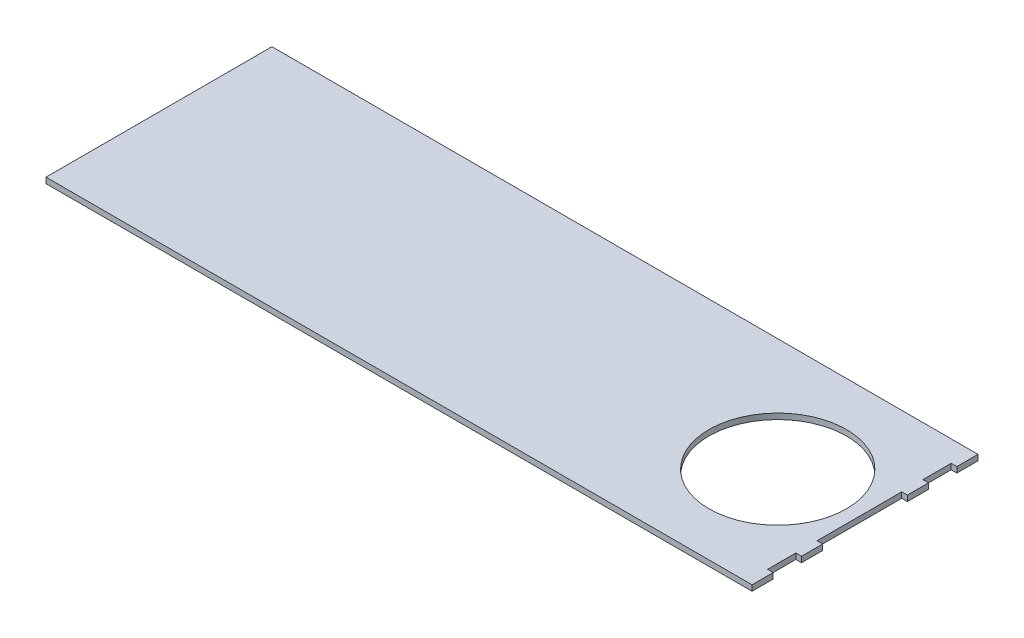
ISO-10303-21;
HEADER;
FILE_DESCRIPTION(('STEP AP214'),'2;1');
FILE_NAME('part.step','',(''),(''),'','','');
FILE_SCHEMA(('AUTOMOTIVE_DESIGN { 1 0 10303 214 1 1 1 1 }'));
ENDSEC;
DATA;
#1=APPLICATION_CONTEXT('core data for automotive mechanical design processes');
#2=APPLICATION_PROTOCOL_DEFINITION('international standard','automotive_design',2000,#1);
#3=PRODUCT_CONTEXT('',#1,'mechanical');
#4=PRODUCT('Part','Part','',(#3));
#5=PRODUCT_RELATED_PRODUCT_CATEGORY('part','',(#4));
#6=PRODUCT_DEFINITION_FORMATION('','',#4);
#7=PRODUCT_DEFINITION_CONTEXT('part definition',#1,'design');
#8=PRODUCT_DEFINITION('design','',#6,#7);
#9=PRODUCT_DEFINITION_SHAPE('','',#8);
#10=(LENGTH_UNIT() NAMED_UNIT(*) SI_UNIT(.MILLI.,.METRE.));
#11=(NAMED_UNIT(*) PLANE_ANGLE_UNIT() SI_UNIT($,.RADIAN.));
#12=(NAMED_UNIT(*) SI_UNIT($,.STERADIAN.) SOLID_ANGLE_UNIT());
#13=UNCERTAINTY_MEASURE_WITH_UNIT(LENGTH_MEASURE(1.E-05),#10,'distance_accuracy_value','');
#14=(GEOMETRIC_REPRESENTATION_CONTEXT(3) GLOBAL_UNCERTAINTY_ASSIGNED_CONTEXT((#13)) GLOBAL_UNIT_ASSIGNED_CONTEXT((#10,
#11,#12)) REPRESENTATION_CONTEXT('',''));
#15=CARTESIAN_POINT('',(0.,0.,0.));
#16=DIRECTION('',(0.,0.,1.));
#17=DIRECTION('',(1.,0.,0.));
#18=AXIS2_PLACEMENT_3D('',#15,#16,#17);
#19=CARTESIAN_POINT('',(317.5,5.08,101.6));
#20=DIRECTION('',(-1.,0.,0.));
#21=DIRECTION('',(0.,0.,1.));
#22=AXIS2_PLACEMENT_3D('',#19,#20,#21);
#23=PLANE('',#22);
#24=DIRECTION('',(0.,0.,-1.));
#25=VECTOR('',#24,1.);
#26=CARTESIAN_POINT('',(317.5,0.,101.6));
#27=LINE('',#26,#25);
#28=CARTESIAN_POINT('',(317.5,0.,57.15));
#29=VERTEX_POINT('',#28);
#30=CARTESIAN_POINT('',(317.5,0.,38.0999999999999));
#31=VERTEX_POINT('',#30);
#32=EDGE_CURVE('E201',#29,#31,#27,.T.);
#33=ORIENTED_EDGE('',*,*,#32,.T.);
#34=DIRECTION('',(0.,1.,0.));
#35=VECTOR('',#34,1.);
#36=CARTESIAN_POINT('',(317.5,-76.3691456021344,38.0999999999999));
#37=LINE('',#36,#35);
#38=CARTESIAN_POINT('',(317.5,5.08,38.0999999999999));
#39=VERTEX_POINT('',#38);
#40=EDGE_CURVE('E285',#31,#39,#37,.T.);
#41=ORIENTED_EDGE('',*,*,#40,.T.);
#42=DIRECTION('',(0.,0.,-1.));
#43=VECTOR('',#42,1.);
#44=CARTESIAN_POINT('',(317.5,5.08,101.6));
#45=LINE('',#44,#43);
#46=CARTESIAN_POINT('',(317.5,5.08,57.15));
#47=VERTEX_POINT('',#46);
#48=EDGE_CURVE('E170',#47,#39,#45,.T.);
#49=ORIENTED_EDGE('',*,*,#48,.F.);
#50=DIRECTION('',(0.,1.,0.));
#51=VECTOR('',#50,1.);
#52=CARTESIAN_POINT('',(317.5,-76.3691456021344,57.15));
#53=LINE('',#52,#51);
#54=EDGE_CURVE('E239',#29,#47,#53,.T.);
#55=ORIENTED_EDGE('',*,*,#54,.F.);
#56=EDGE_LOOP('',(#33,#41,#49,#55));
#57=FACE_BOUND('',#56,.T.);
#58=ADVANCED_FACE('F33',(#57),#23,.F.);
#59=CARTESIAN_POINT('',(317.5,0.,101.6));
#60=VERTEX_POINT('',#59);
#61=CARTESIAN_POINT('',(317.5,0.,82.55));
#62=VERTEX_POINT('',#61);
#63=EDGE_CURVE('E197',#60,#62,#27,.T.);
#64=ORIENTED_EDGE('',*,*,#63,.T.);
#65=DIRECTION('',(0.,1.,0.));
#66=VECTOR('',#65,1.);
#67=CARTESIAN_POINT('',(317.5,-76.3691456021344,82.55));
#68=LINE('',#67,#66);
#69=CARTESIAN_POINT('',(317.5,5.08,82.55));
#70=VERTEX_POINT('',#69);
#71=EDGE_CURVE('E228',#62,#70,#68,.T.);
#72=ORIENTED_EDGE('',*,*,#71,.T.);
#73=CARTESIAN_POINT('',(317.5,5.08,101.6));
#74=VERTEX_POINT('',#73);
#75=EDGE_CURVE('E173',#74,#70,#45,.T.);
#76=ORIENTED_EDGE('',*,*,#75,.F.);
#77=DIRECTION('',(0.,-1.,0.));
#78=VECTOR('',#77,1.);
#79=CARTESIAN_POINT('',(317.5,5.08,101.6));
#80=LINE('',#79,#78);
#81=EDGE_CURVE('E41',#74,#60,#80,.T.);
#82=ORIENTED_EDGE('',*,*,#81,.T.);
#83=EDGE_LOOP('',(#64,#72,#76,#82));
#84=FACE_BOUND('',#83,.T.);
#85=ADVANCED_FACE('F210',(#84),#23,.F.);
#86=CARTESIAN_POINT('',(317.5,5.08,-38.1000000000001));
#87=VERTEX_POINT('',#86);
#88=CARTESIAN_POINT('',(317.5,5.08,-57.1500000000001));
#89=VERTEX_POINT('',#88);
#90=EDGE_CURVE('E160',#87,#89,#45,.T.);
#91=ORIENTED_EDGE('',*,*,#90,.F.);
#92=DIRECTION('',(0.,1.,0.));
#93=VECTOR('',#92,1.);
#94=CARTESIAN_POINT('',(317.5,-76.3691456021344,-38.1000000000001));
#95=LINE('',#94,#93);
#96=CARTESIAN_POINT('',(317.5,0.,-38.1000000000001));
#97=VERTEX_POINT('',#96);
#98=EDGE_CURVE('E144',#97,#87,#95,.T.);
#99=ORIENTED_EDGE('',*,*,#98,.F.);
#100=CARTESIAN_POINT('',(317.5,0.,-57.1500000000001));
#101=VERTEX_POINT('',#100);
#102=EDGE_CURVE('E202',#97,#101,#27,.T.);
#103=ORIENTED_EDGE('',*,*,#102,.T.);
#104=DIRECTION('',(0.,1.,0.));
#105=VECTOR('',#104,1.);
#106=CARTESIAN_POINT('',(317.5,-76.3691456021344,-57.1500000000001));
#107=LINE('',#106,#105);
#108=EDGE_CURVE('E169',#101,#89,#107,.T.);
#109=ORIENTED_EDGE('',*,*,#108,.T.);
#110=EDGE_LOOP('',(#91,#99,#103,#109));
#111=FACE_BOUND('',#110,.T.);
#112=ADVANCED_FACE('F167',(#111),#23,.F.);
#113=CARTESIAN_POINT('',(-317.5,5.08,101.6));
#114=DIRECTION('',(1.,0.,0.));
#115=DIRECTION('',(0.,0.,-1.));
#116=AXIS2_PLACEMENT_3D('',#113,#114,#115);
#117=PLANE('',#116);
#118=DIRECTION('',(0.,0.,1.));
#119=VECTOR('',#118,1.);
#120=CARTESIAN_POINT('',(-317.5,0.,101.6));
#121=LINE('',#120,#119);
#122=CARTESIAN_POINT('',(-317.5,0.,-101.6));
#123=VERTEX_POINT('',#122);
#124=CARTESIAN_POINT('',(-317.5,0.,101.6));
#125=VERTEX_POINT('',#124);
#126=EDGE_CURVE('E190',#123,#125,#121,.T.);
#127=ORIENTED_EDGE('',*,*,#126,.T.);
#128=DIRECTION('',(0.,-1.,0.));
#129=VECTOR('',#128,1.);
#130=CARTESIAN_POINT('',(-317.5,5.08,101.6));
#131=LINE('',#130,#129);
#132=CARTESIAN_POINT('',(-317.5,5.08,101.6));
#133=VERTEX_POINT('',#132);
#134=EDGE_CURVE('E11',#133,#125,#131,.T.);
#135=ORIENTED_EDGE('',*,*,#134,.F.);
#136=DIRECTION('',(0.,0.,1.));
#137=VECTOR('',#136,1.);
#138=CARTESIAN_POINT('',(-317.5,5.08,101.6));
#139=LINE('',#138,#137);
#140=CARTESIAN_POINT('',(-317.5,5.08,-101.6));
#141=VERTEX_POINT('',#140);
#142=EDGE_CURVE('E203',#141,#133,#139,.T.);
#143=ORIENTED_EDGE('',*,*,#142,.F.);
#144=DIRECTION('',(0.,-1.,0.));
#145=VECTOR('',#144,1.);
#146=CARTESIAN_POINT('',(-317.5,5.08,-101.6));
#147=LINE('',#146,#145);
#148=EDGE_CURVE('E182',#141,#123,#147,.T.);
#149=ORIENTED_EDGE('',*,*,#148,.T.);
#150=EDGE_LOOP('',(#127,#135,#143,#149));
#151=FACE_BOUND('',#150,.T.);
#152=ADVANCED_FACE('F35',(#151),#117,.F.);
#153=CARTESIAN_POINT('',(317.5,5.08,101.6));
#154=DIRECTION('',(0.,0.,-1.));
#155=DIRECTION('',(-1.,0.,0.));
#156=AXIS2_PLACEMENT_3D('',#153,#154,#155);
#157=PLANE('',#156);
#158=DIRECTION('',(1.,0.,0.));
#159=VECTOR('',#158,1.);
#160=CARTESIAN_POINT('',(317.5,0.,101.6));
#161=LINE('',#160,#159);
#162=EDGE_CURVE('E193',#125,#60,#161,.T.);
#163=ORIENTED_EDGE('',*,*,#162,.T.);
#164=ORIENTED_EDGE('',*,*,#81,.F.);
#165=DIRECTION('',(1.,0.,0.));
#166=VECTOR('',#165,1.);
#167=CARTESIAN_POINT('',(317.5,5.08,101.6));
#168=LINE('',#167,#166);
#169=EDGE_CURVE('E175',#133,#74,#168,.T.);
#170=ORIENTED_EDGE('',*,*,#169,.F.);
#171=ORIENTED_EDGE('',*,*,#134,.T.);
#172=EDGE_LOOP('',(#163,#164,#170,#171));
#173=FACE_BOUND('',#172,.T.);
#174=ADVANCED_FACE('F267',(#173),#157,.F.);
#175=CARTESIAN_POINT('',(317.5,5.08,-82.5500000000001));
#176=VERTEX_POINT('',#175);
#177=CARTESIAN_POINT('',(317.5,5.08,-101.6));
#178=VERTEX_POINT('',#177);
#179=EDGE_CURVE('E171',#176,#178,#45,.T.);
#180=ORIENTED_EDGE('',*,*,#179,.F.);
#181=DIRECTION('',(0.,1.,0.));
#182=VECTOR('',#181,1.);
#183=CARTESIAN_POINT('',(317.5,-76.3691456021344,-82.5500000000001));
#184=LINE('',#183,#182);
#185=CARTESIAN_POINT('',(317.5,0.,-82.5500000000001));
#186=VERTEX_POINT('',#185);
#187=EDGE_CURVE('E257',#186,#176,#184,.T.);
#188=ORIENTED_EDGE('',*,*,#187,.F.);
#189=CARTESIAN_POINT('',(317.5,0.,-101.6));
#190=VERTEX_POINT('',#189);
#191=EDGE_CURVE('E196',#186,#190,#27,.T.);
#192=ORIENTED_EDGE('',*,*,#191,.T.);
#193=DIRECTION('',(0.,-1.,0.));
#194=VECTOR('',#193,1.);
#195=CARTESIAN_POINT('',(317.5,5.08,-101.6));
#196=LINE('',#195,#194);
#197=EDGE_CURVE('E187',#178,#190,#196,.T.);
#198=ORIENTED_EDGE('',*,*,#197,.F.);
#199=EDGE_LOOP('',(#180,#188,#192,#198));
#200=FACE_BOUND('',#199,.T.);
#201=ADVANCED_FACE('F277',(#200),#23,.F.);
#202=CARTESIAN_POINT('',(317.5,5.08,-101.6));
#203=DIRECTION('',(0.,0.,1.));
#204=DIRECTION('',(1.,0.,0.));
#205=AXIS2_PLACEMENT_3D('',#202,#203,#204);
#206=PLANE('',#205);
#207=DIRECTION('',(-1.,0.,0.));
#208=VECTOR('',#207,1.);
#209=CARTESIAN_POINT('',(317.5,0.,-101.6));
#210=LINE('',#209,#208);
#211=EDGE_CURVE('E200',#190,#123,#210,.T.);
#212=ORIENTED_EDGE('',*,*,#211,.T.);
#213=ORIENTED_EDGE('',*,*,#148,.F.);
#214=DIRECTION('',(-1.,0.,0.));
#215=VECTOR('',#214,1.);
#216=CARTESIAN_POINT('',(317.5,5.08,-101.6));
#217=LINE('',#216,#215);
#218=EDGE_CURVE('E179',#178,#141,#217,.T.);
#219=ORIENTED_EDGE('',*,*,#218,.F.);
#220=ORIENTED_EDGE('',*,*,#197,.T.);
#221=EDGE_LOOP('',(#212,#213,#219,#220));
#222=FACE_BOUND('',#221,.T.);
#223=ADVANCED_FACE('F273',(#222),#206,.F.);
#224=CARTESIAN_POINT('',(0.,5.08,0.));
#225=DIRECTION('',(0.,1.,0.));
#226=DIRECTION('',(0.,0.,1.));
#227=AXIS2_PLACEMENT_3D('',#224,#225,#226);
#228=PLANE('',#227);
#229=CARTESIAN_POINT('',(238.966470335924,5.08,0.));
#230=DIRECTION('',(0.,1.,0.));
#231=DIRECTION('',(0.,0.,1.));
#232=AXIS2_PLACEMENT_3D('',#229,#230,#231);
#233=CIRCLE('',#232,61.8098417908649);
#234=CARTESIAN_POINT('',(238.966470335924,5.08,61.8098417908648));
#235=VERTEX_POINT('',#234);
#236=EDGE_CURVE('E466',#235,#235,#233,.T.);
#237=ORIENTED_EDGE('',*,*,#236,.F.);
#238=EDGE_LOOP('',(#237));
#239=FACE_BOUND('',#238,.T.);
#240=DIRECTION('',(1.,0.,0.));
#241=VECTOR('',#240,1.);
#242=CARTESIAN_POINT('',(317.5,5.08,38.0999999999999));
#243=LINE('',#242,#241);
#244=CARTESIAN_POINT('',(312.42,5.08,38.0999999999999));
#245=VERTEX_POINT('',#244);
#246=EDGE_CURVE('E154',#245,#39,#243,.T.);
#247=ORIENTED_EDGE('',*,*,#246,.F.);
#248=DIRECTION('',(0.,0.,1.));
#249=VECTOR('',#248,1.);
#250=CARTESIAN_POINT('',(312.42,5.08,-38.1000000000001));
#251=LINE('',#250,#249);
#252=CARTESIAN_POINT('',(312.42,5.08,-38.1000000000001));
#253=VERTEX_POINT('',#252);
#254=EDGE_CURVE('E163',#253,#245,#251,.T.);
#255=ORIENTED_EDGE('',*,*,#254,.F.);
#256=DIRECTION('',(-1.,0.,0.));
#257=VECTOR('',#256,1.);
#258=CARTESIAN_POINT('',(317.5,5.08,-38.1000000000001));
#259=LINE('',#258,#257);
#260=EDGE_CURVE('E147',#87,#253,#259,.T.);
#261=ORIENTED_EDGE('',*,*,#260,.F.);
#262=ORIENTED_EDGE('',*,*,#90,.T.);
#263=DIRECTION('',(1.,0.,0.));
#264=VECTOR('',#263,1.);
#265=CARTESIAN_POINT('',(317.5,5.08,-57.1500000000001));
#266=LINE('',#265,#264);
#267=CARTESIAN_POINT('',(312.42,5.08,-57.1500000000001));
#268=VERTEX_POINT('',#267);
#269=EDGE_CURVE('E255',#268,#89,#266,.T.);
#270=ORIENTED_EDGE('',*,*,#269,.F.);
#271=DIRECTION('',(0.,0.,1.));
#272=VECTOR('',#271,1.);
#273=CARTESIAN_POINT('',(312.42,5.08,-82.5500000000001));
#274=LINE('',#273,#272);
#275=CARTESIAN_POINT('',(312.42,5.08,-82.5500000000001));
#276=VERTEX_POINT('',#275);
#277=EDGE_CURVE('E252',#276,#268,#274,.T.);
#278=ORIENTED_EDGE('',*,*,#277,.F.);
#279=DIRECTION('',(-1.,0.,0.));
#280=VECTOR('',#279,1.);
#281=CARTESIAN_POINT('',(317.5,5.08,-82.5500000000001));
#282=LINE('',#281,#280);
#283=EDGE_CURVE('E226',#176,#276,#282,.T.);
#284=ORIENTED_EDGE('',*,*,#283,.F.);
#285=ORIENTED_EDGE('',*,*,#179,.T.);
#286=ORIENTED_EDGE('',*,*,#218,.T.);
#287=ORIENTED_EDGE('',*,*,#142,.T.);
#288=ORIENTED_EDGE('',*,*,#169,.T.);
#289=ORIENTED_EDGE('',*,*,#75,.T.);
#290=DIRECTION('',(1.,0.,0.));
#291=VECTOR('',#290,1.);
#292=CARTESIAN_POINT('',(317.5,5.08,82.55));
#293=LINE('',#292,#291);
#294=CARTESIAN_POINT('',(312.42,5.08,82.55));
#295=VERTEX_POINT('',#294);
#296=EDGE_CURVE('E237',#295,#70,#293,.T.);
#297=ORIENTED_EDGE('',*,*,#296,.F.);
#298=DIRECTION('',(0.,0.,1.));
#299=VECTOR('',#298,1.);
#300=CARTESIAN_POINT('',(312.42,5.08,57.15));
#301=LINE('',#300,#299);
#302=CARTESIAN_POINT('',(312.42,5.08,57.15));
#303=VERTEX_POINT('',#302);
#304=EDGE_CURVE('E234',#303,#295,#301,.T.);
#305=ORIENTED_EDGE('',*,*,#304,.F.);
#306=DIRECTION('',(-1.,0.,0.));
#307=VECTOR('',#306,1.);
#308=CARTESIAN_POINT('',(317.5,5.08,57.15));
#309=LINE('',#308,#307);
#310=EDGE_CURVE('E232',#47,#303,#309,.T.);
#311=ORIENTED_EDGE('',*,*,#310,.F.);
#312=ORIENTED_EDGE('',*,*,#48,.T.);
#313=EDGE_LOOP('',(#247,#255,#261,#262,#270,#278,#284,#285,#286,#287,#288,#289,#297,#305,#311,#312));
#314=FACE_BOUND('',#313,.T.);
#315=ADVANCED_FACE('F158',(#239,#314),#228,.T.);
#316=CARTESIAN_POINT('',(0.,0.,0.));
#317=DIRECTION('',(0.,1.,0.));
#318=DIRECTION('',(0.,0.,1.));
#319=AXIS2_PLACEMENT_3D('',#316,#317,#318);
#320=PLANE('',#319);
#321=CARTESIAN_POINT('',(238.966470335924,0.,0.));
#322=DIRECTION('',(0.,1.,0.));
#323=DIRECTION('',(0.,0.,1.));
#324=AXIS2_PLACEMENT_3D('',#321,#322,#323);
#325=CIRCLE('',#324,61.8098417908649);
#326=CARTESIAN_POINT('',(238.966470335924,0.,61.8098417908648));
#327=VERTEX_POINT('',#326);
#328=EDGE_CURVE('E164',#327,#327,#325,.F.);
#329=ORIENTED_EDGE('',*,*,#328,.F.);
#330=EDGE_LOOP('',(#329));
#331=FACE_BOUND('',#330,.T.);
#332=DIRECTION('',(0.,0.,-1.));
#333=VECTOR('',#332,1.);
#334=CARTESIAN_POINT('',(312.42,0.,-38.1000000000001));
#335=LINE('',#334,#333);
#336=CARTESIAN_POINT('',(312.42,0.,38.0999999999999));
#337=VERTEX_POINT('',#336);
#338=CARTESIAN_POINT('',(312.42,0.,-38.1000000000001));
#339=VERTEX_POINT('',#338);
#340=EDGE_CURVE('E288',#337,#339,#335,.T.);
#341=ORIENTED_EDGE('',*,*,#340,.F.);
#342=DIRECTION('',(-1.,0.,0.));
#343=VECTOR('',#342,1.);
#344=CARTESIAN_POINT('',(317.5,0.,38.0999999999999));
#345=LINE('',#344,#343);
#346=EDGE_CURVE('E287',#31,#337,#345,.T.);
#347=ORIENTED_EDGE('',*,*,#346,.F.);
#348=ORIENTED_EDGE('',*,*,#32,.F.);
#349=DIRECTION('',(1.,0.,0.));
#350=VECTOR('',#349,1.);
#351=CARTESIAN_POINT('',(317.5,0.,57.15));
#352=LINE('',#351,#350);
#353=CARTESIAN_POINT('',(312.42,0.,57.15));
#354=VERTEX_POINT('',#353);
#355=EDGE_CURVE('E224',#354,#29,#352,.T.);
#356=ORIENTED_EDGE('',*,*,#355,.F.);
#357=DIRECTION('',(0.,0.,-1.));
#358=VECTOR('',#357,1.);
#359=CARTESIAN_POINT('',(312.42,0.,57.15));
#360=LINE('',#359,#358);
#361=CARTESIAN_POINT('',(312.42,0.,82.55));
#362=VERTEX_POINT('',#361);
#363=EDGE_CURVE('E221',#362,#354,#360,.T.);
#364=ORIENTED_EDGE('',*,*,#363,.F.);
#365=DIRECTION('',(-1.,0.,0.));
#366=VECTOR('',#365,1.);
#367=CARTESIAN_POINT('',(317.5,0.,82.55));
#368=LINE('',#367,#366);
#369=EDGE_CURVE('E219',#62,#362,#368,.T.);
#370=ORIENTED_EDGE('',*,*,#369,.F.);
#371=ORIENTED_EDGE('',*,*,#63,.F.);
#372=ORIENTED_EDGE('',*,*,#162,.F.);
#373=ORIENTED_EDGE('',*,*,#126,.F.);
#374=ORIENTED_EDGE('',*,*,#211,.F.);
#375=ORIENTED_EDGE('',*,*,#191,.F.);
#376=DIRECTION('',(1.,0.,0.));
#377=VECTOR('',#376,1.);
#378=CARTESIAN_POINT('',(317.5,0.,-82.5500000000001));
#379=LINE('',#378,#377);
#380=CARTESIAN_POINT('',(312.42,0.,-82.5500000000001));
#381=VERTEX_POINT('',#380);
#382=EDGE_CURVE('E194',#381,#186,#379,.T.);
#383=ORIENTED_EDGE('',*,*,#382,.F.);
#384=DIRECTION('',(0.,0.,-1.));
#385=VECTOR('',#384,1.);
#386=CARTESIAN_POINT('',(312.42,0.,-82.5500000000001));
#387=LINE('',#386,#385);
#388=CARTESIAN_POINT('',(312.42,0.,-57.1500000000001));
#389=VERTEX_POINT('',#388);
#390=EDGE_CURVE('E245',#389,#381,#387,.T.);
#391=ORIENTED_EDGE('',*,*,#390,.F.);
#392=DIRECTION('',(-1.,0.,0.));
#393=VECTOR('',#392,1.);
#394=CARTESIAN_POINT('',(317.5,0.,-57.1500000000001));
#395=LINE('',#394,#393);
#396=EDGE_CURVE('E248',#101,#389,#395,.T.);
#397=ORIENTED_EDGE('',*,*,#396,.F.);
#398=ORIENTED_EDGE('',*,*,#102,.F.);
#399=DIRECTION('',(1.,0.,0.));
#400=VECTOR('',#399,1.);
#401=CARTESIAN_POINT('',(317.5,0.,-38.1000000000001));
#402=LINE('',#401,#400);
#403=EDGE_CURVE('E150',#339,#97,#402,.T.);
#404=ORIENTED_EDGE('',*,*,#403,.F.);
#405=EDGE_LOOP('',(#341,#347,#348,#356,#364,#370,#371,#372,#373,#374,#375,#383,#391,#397,#398,#404));
#406=FACE_BOUND('',#405,.T.);
#407=ADVANCED_FACE('F216',(#331,#406),#320,.F.);
#408=CARTESIAN_POINT('',(317.5,-76.3691456021344,-57.1500000000001));
#409=DIRECTION('',(0.,0.,1.));
#410=DIRECTION('',(1.,0.,0.));
#411=AXIS2_PLACEMENT_3D('',#408,#409,#410);
#412=PLANE('',#411);
#413=ORIENTED_EDGE('',*,*,#396,.T.);
#414=DIRECTION('',(0.,1.,0.));
#415=VECTOR('',#414,1.);
#416=CARTESIAN_POINT('',(312.42,-76.3691456021344,-57.1500000000001));
#417=LINE('',#416,#415);
#418=EDGE_CURVE('E259',#389,#268,#417,.T.);
#419=ORIENTED_EDGE('',*,*,#418,.T.);
#420=ORIENTED_EDGE('',*,*,#269,.T.);
#421=ORIENTED_EDGE('',*,*,#108,.F.);
#422=EDGE_LOOP('',(#413,#419,#420,#421));
#423=FACE_BOUND('',#422,.T.);
#424=ADVANCED_FACE('F305',(#423),#412,.F.);
#425=CARTESIAN_POINT('',(312.42,-76.3691456021344,-82.5500000000001));
#426=DIRECTION('',(-1.,0.,0.));
#427=DIRECTION('',(0.,0.,1.));
#428=AXIS2_PLACEMENT_3D('',#425,#426,#427);
#429=PLANE('',#428);
#430=ORIENTED_EDGE('',*,*,#390,.T.);
#431=DIRECTION('',(0.,1.,0.));
#432=VECTOR('',#431,1.);
#433=CARTESIAN_POINT('',(312.42,-76.3691456021344,-82.5500000000001));
#434=LINE('',#433,#432);
#435=EDGE_CURVE('E261',#381,#276,#434,.T.);
#436=ORIENTED_EDGE('',*,*,#435,.T.);
#437=ORIENTED_EDGE('',*,*,#277,.T.);
#438=ORIENTED_EDGE('',*,*,#418,.F.);
#439=EDGE_LOOP('',(#430,#436,#437,#438));
#440=FACE_BOUND('',#439,.T.);
#441=ADVANCED_FACE('F310',(#440),#429,.F.);
#442=CARTESIAN_POINT('',(317.5,-76.3691456021344,-82.5500000000001));
#443=DIRECTION('',(0.,0.,-1.));
#444=DIRECTION('',(-1.,0.,0.));
#445=AXIS2_PLACEMENT_3D('',#442,#443,#444);
#446=PLANE('',#445);
#447=ORIENTED_EDGE('',*,*,#382,.T.);
#448=ORIENTED_EDGE('',*,*,#187,.T.);
#449=ORIENTED_EDGE('',*,*,#283,.T.);
#450=ORIENTED_EDGE('',*,*,#435,.F.);
#451=EDGE_LOOP('',(#447,#448,#449,#450));
#452=FACE_BOUND('',#451,.T.);
#453=ADVANCED_FACE('F312',(#452),#446,.F.);
#454=CARTESIAN_POINT('',(317.5,-76.3691456021344,82.55));
#455=DIRECTION('',(0.,0.,1.));
#456=DIRECTION('',(1.,0.,0.));
#457=AXIS2_PLACEMENT_3D('',#454,#455,#456);
#458=PLANE('',#457);
#459=ORIENTED_EDGE('',*,*,#369,.T.);
#460=DIRECTION('',(0.,1.,0.));
#461=VECTOR('',#460,1.);
#462=CARTESIAN_POINT('',(312.42,-76.3691456021344,82.55));
#463=LINE('',#462,#461);
#464=EDGE_CURVE('E241',#362,#295,#463,.T.);
#465=ORIENTED_EDGE('',*,*,#464,.T.);
#466=ORIENTED_EDGE('',*,*,#296,.T.);
#467=ORIENTED_EDGE('',*,*,#71,.F.);
#468=EDGE_LOOP('',(#459,#465,#466,#467));
#469=FACE_BOUND('',#468,.T.);
#470=ADVANCED_FACE('F314',(#469),#458,.F.);
#471=CARTESIAN_POINT('',(312.42,-76.3691456021344,57.15));
#472=DIRECTION('',(-1.,0.,0.));
#473=DIRECTION('',(0.,0.,1.));
#474=AXIS2_PLACEMENT_3D('',#471,#472,#473);
#475=PLANE('',#474);
#476=ORIENTED_EDGE('',*,*,#363,.T.);
#477=DIRECTION('',(0.,1.,0.));
#478=VECTOR('',#477,1.);
#479=CARTESIAN_POINT('',(312.42,-76.3691456021344,57.15));
#480=LINE('',#479,#478);
#481=EDGE_CURVE('E56',#354,#303,#480,.T.);
#482=ORIENTED_EDGE('',*,*,#481,.T.);
#483=ORIENTED_EDGE('',*,*,#304,.T.);
#484=ORIENTED_EDGE('',*,*,#464,.F.);
#485=EDGE_LOOP('',(#476,#482,#483,#484));
#486=FACE_BOUND('',#485,.T.);
#487=ADVANCED_FACE('F320',(#486),#475,.F.);
#488=CARTESIAN_POINT('',(317.5,-76.3691456021344,57.15));
#489=DIRECTION('',(0.,0.,-1.));
#490=DIRECTION('',(-1.,0.,0.));
#491=AXIS2_PLACEMENT_3D('',#488,#489,#490);
#492=PLANE('',#491);
#493=ORIENTED_EDGE('',*,*,#355,.T.);
#494=ORIENTED_EDGE('',*,*,#54,.T.);
#495=ORIENTED_EDGE('',*,*,#310,.T.);
#496=ORIENTED_EDGE('',*,*,#481,.F.);
#497=EDGE_LOOP('',(#493,#494,#495,#496));
#498=FACE_BOUND('',#497,.T.);
#499=ADVANCED_FACE('F415',(#498),#492,.F.);
#500=CARTESIAN_POINT('',(317.5,-76.3691456021344,38.0999999999999));
#501=DIRECTION('',(0.,0.,1.));
#502=DIRECTION('',(1.,0.,0.));
#503=AXIS2_PLACEMENT_3D('',#500,#501,#502);
#504=PLANE('',#503);
#505=ORIENTED_EDGE('',*,*,#346,.T.);
#506=DIRECTION('',(0.,1.,0.));
#507=VECTOR('',#506,1.);
#508=CARTESIAN_POINT('',(312.42,-76.3691456021344,38.0999999999999));
#509=LINE('',#508,#507);
#510=EDGE_CURVE('E298',#337,#245,#509,.T.);
#511=ORIENTED_EDGE('',*,*,#510,.T.);
#512=ORIENTED_EDGE('',*,*,#246,.T.);
#513=ORIENTED_EDGE('',*,*,#40,.F.);
#514=EDGE_LOOP('',(#505,#511,#512,#513));
#515=FACE_BOUND('',#514,.T.);
#516=ADVANCED_FACE('F425',(#515),#504,.F.);
#517=CARTESIAN_POINT('',(312.42,-76.3691456021344,-38.1000000000001));
#518=DIRECTION('',(-1.,0.,0.));
#519=DIRECTION('',(0.,0.,1.));
#520=AXIS2_PLACEMENT_3D('',#517,#518,#519);
#521=PLANE('',#520);
#522=ORIENTED_EDGE('',*,*,#340,.T.);
#523=DIRECTION('',(0.,1.,0.));
#524=VECTOR('',#523,1.);
#525=CARTESIAN_POINT('',(312.42,-76.3691456021344,-38.1000000000001));
#526=LINE('',#525,#524);
#527=EDGE_CURVE('E48',#339,#253,#526,.T.);
#528=ORIENTED_EDGE('',*,*,#527,.T.);
#529=ORIENTED_EDGE('',*,*,#254,.T.);
#530=ORIENTED_EDGE('',*,*,#510,.F.);
#531=EDGE_LOOP('',(#522,#528,#529,#530));
#532=FACE_BOUND('',#531,.T.);
#533=ADVANCED_FACE('F301',(#532),#521,.F.);
#534=CARTESIAN_POINT('',(317.5,-76.3691456021344,-38.1000000000001));
#535=DIRECTION('',(0.,0.,-1.));
#536=DIRECTION('',(-1.,0.,0.));
#537=AXIS2_PLACEMENT_3D('',#534,#535,#536);
#538=PLANE('',#537);
#539=ORIENTED_EDGE('',*,*,#403,.T.);
#540=ORIENTED_EDGE('',*,*,#98,.T.);
#541=ORIENTED_EDGE('',*,*,#260,.T.);
#542=ORIENTED_EDGE('',*,*,#527,.F.);
#543=EDGE_LOOP('',(#539,#540,#541,#542));
#544=FACE_BOUND('',#543,.T.);
#545=ADVANCED_FACE('F146',(#544),#538,.F.);
#546=CARTESIAN_POINT('',(238.966470335924,-174.824633097553,0.));
#547=DIRECTION('',(0.,1.,0.));
#548=DIRECTION('',(0.,0.,1.));
#549=AXIS2_PLACEMENT_3D('',#546,#547,#548);
#550=CYLINDRICAL_SURFACE('',#549,61.8098417908649);
#551=ORIENTED_EDGE('',*,*,#328,.T.);
#552=EDGE_LOOP('',(#551));
#553=FACE_BOUND('',#552,.T.);
#554=ORIENTED_EDGE('',*,*,#236,.T.);
#555=EDGE_LOOP('',(#554));
#556=FACE_BOUND('',#555,.T.);
#557=ADVANCED_FACE('F448',(#553,#556),#550,.F.);
#558=CLOSED_SHELL('',(#58,#85,#112,#152,#174,#201,#223,#315,#407,#424,#441,#453,#470,#487,#499,
#516,#533,#545,#557));
#559=MANIFOLD_SOLID_BREP('B2',#558);
#560=ADVANCED_BREP_SHAPE_REPRESENTATION('',(#18,#559),#14);
#561=SHAPE_DEFINITION_REPRESENTATION(#9,#560);
ENDSEC;
END-ISO-10303-21;
